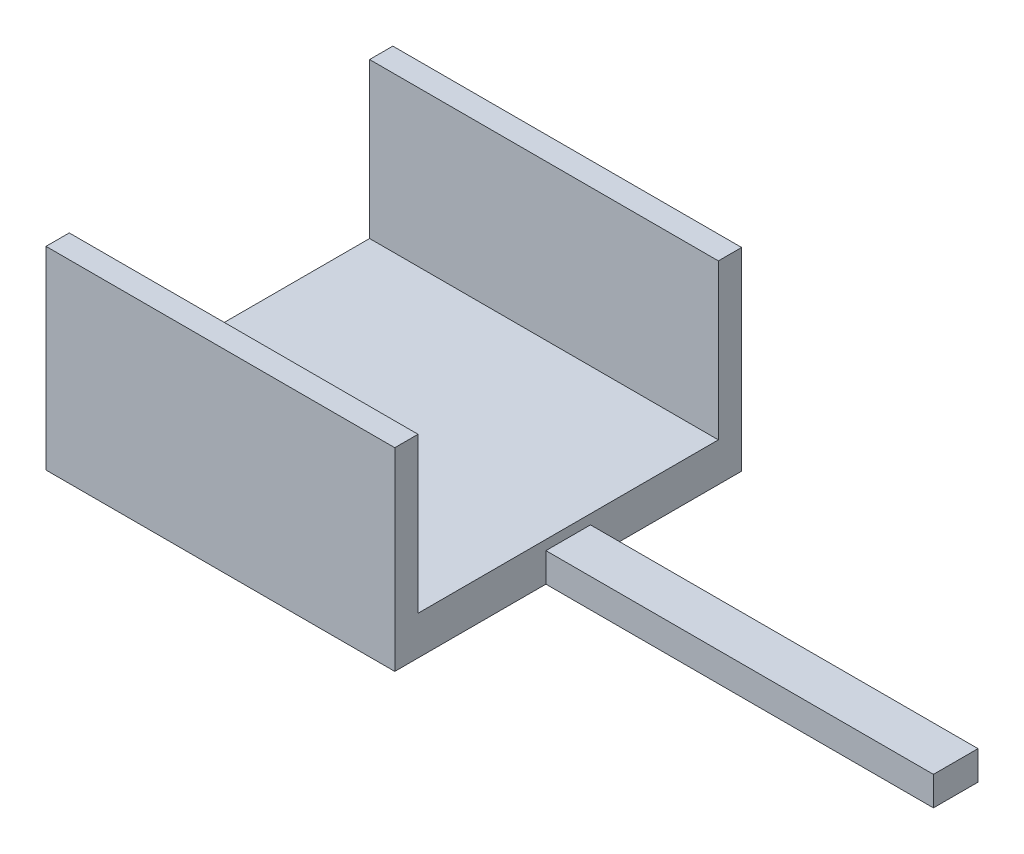
ISO-10303-21;
HEADER;
FILE_DESCRIPTION(('STEP AP214'),'2;1');
FILE_NAME('part.step','',(''),(''),'','','');
FILE_SCHEMA(('AUTOMOTIVE_DESIGN { 1 0 10303 214 1 1 1 1 }'));
ENDSEC;
DATA;
#1=APPLICATION_CONTEXT('core data for automotive mechanical design processes');
#2=APPLICATION_PROTOCOL_DEFINITION('international standard','automotive_design',2000,#1);
#3=PRODUCT_CONTEXT('',#1,'mechanical');
#4=PRODUCT('Part','Part','',(#3));
#5=PRODUCT_RELATED_PRODUCT_CATEGORY('part','',(#4));
#6=PRODUCT_DEFINITION_FORMATION('','',#4);
#7=PRODUCT_DEFINITION_CONTEXT('part definition',#1,'design');
#8=PRODUCT_DEFINITION('design','',#6,#7);
#9=PRODUCT_DEFINITION_SHAPE('','',#8);
#10=(LENGTH_UNIT() NAMED_UNIT(*) SI_UNIT(.MILLI.,.METRE.));
#11=(NAMED_UNIT(*) PLANE_ANGLE_UNIT() SI_UNIT($,.RADIAN.));
#12=(NAMED_UNIT(*) SI_UNIT($,.STERADIAN.) SOLID_ANGLE_UNIT());
#13=UNCERTAINTY_MEASURE_WITH_UNIT(LENGTH_MEASURE(1.E-05),#10,'distance_accuracy_value','');
#14=(GEOMETRIC_REPRESENTATION_CONTEXT(3) GLOBAL_UNCERTAINTY_ASSIGNED_CONTEXT((#13)) GLOBAL_UNIT_ASSIGNED_CONTEXT((#10,
#11,#12)) REPRESENTATION_CONTEXT('',''));
#15=CARTESIAN_POINT('',(0.,0.,0.));
#16=DIRECTION('',(0.,0.,1.));
#17=DIRECTION('',(1.,0.,0.));
#18=AXIS2_PLACEMENT_3D('',#15,#16,#17);
#19=CARTESIAN_POINT('',(0.,2.,0.));
#20=DIRECTION('',(0.,1.,0.));
#21=DIRECTION('',(0.,0.,1.));
#22=AXIS2_PLACEMENT_3D('',#19,#20,#21);
#23=PLANE('',#22);
#24=DIRECTION('',(0.,0.,1.));
#25=VECTOR('',#24,1.);
#26=CARTESIAN_POINT('',(0.,2.,-17.9));
#27=LINE('',#26,#25);
#28=CARTESIAN_POINT('',(0.,2.,-16.7));
#29=VERTEX_POINT('',#28);
#30=CARTESIAN_POINT('',(0.,2.,-1.2));
#31=VERTEX_POINT('',#30);
#32=EDGE_CURVE('E173',#29,#31,#27,.T.);
#33=ORIENTED_EDGE('',*,*,#32,.T.);
#34=DIRECTION('',(-1.,0.,0.));
#35=VECTOR('',#34,1.);
#36=CARTESIAN_POINT('',(0.,2.,-1.2));
#37=LINE('',#36,#35);
#38=CARTESIAN_POINT('',(18.,2.,-1.20000000000001));
#39=VERTEX_POINT('',#38);
#40=EDGE_CURVE('E146',#39,#31,#37,.T.);
#41=ORIENTED_EDGE('',*,*,#40,.F.);
#42=DIRECTION('',(0.,0.,-1.));
#43=VECTOR('',#42,1.);
#44=CARTESIAN_POINT('',(18.,2.,-17.9));
#45=LINE('',#44,#43);
#46=CARTESIAN_POINT('',(18.,2.,-16.7));
#47=VERTEX_POINT('',#46);
#48=EDGE_CURVE('E175',#39,#47,#45,.T.);
#49=ORIENTED_EDGE('',*,*,#48,.T.);
#50=DIRECTION('',(1.,0.,0.));
#51=VECTOR('',#50,1.);
#52=CARTESIAN_POINT('',(0.,2.,-16.7));
#53=LINE('',#52,#51);
#54=EDGE_CURVE('E57',#29,#47,#53,.T.);
#55=ORIENTED_EDGE('',*,*,#54,.F.);
#56=EDGE_LOOP('',(#33,#41,#49,#55));
#57=FACE_BOUND('',#56,.T.);
#58=ADVANCED_FACE('F33',(#57),#23,.T.);
#59=CARTESIAN_POINT('',(0.,1.5,0.));
#60=DIRECTION('',(0.,-1.,0.));
#61=DIRECTION('',(0.,0.,-1.));
#62=AXIS2_PLACEMENT_3D('',#59,#60,#61);
#63=PLANE('',#62);
#64=DIRECTION('',(0.,0.,-1.));
#65=VECTOR('',#64,1.);
#66=CARTESIAN_POINT('',(18.,1.5,-17.9));
#67=LINE('',#66,#65);
#68=CARTESIAN_POINT('',(18.,1.5,-7.8));
#69=VERTEX_POINT('',#68);
#70=CARTESIAN_POINT('',(18.,1.5,-10.1));
#71=VERTEX_POINT('',#70);
#72=EDGE_CURVE('E11',#69,#71,#67,.T.);
#73=ORIENTED_EDGE('',*,*,#72,.F.);
#74=DIRECTION('',(1.,0.,0.));
#75=VECTOR('',#74,1.);
#76=CARTESIAN_POINT('',(18.,1.5,-7.8));
#77=LINE('',#76,#75);
#78=CARTESIAN_POINT('',(38.,1.5,-7.8));
#79=VERTEX_POINT('',#78);
#80=EDGE_CURVE('E177',#69,#79,#77,.T.);
#81=ORIENTED_EDGE('',*,*,#80,.T.);
#82=DIRECTION('',(0.,0.,-1.));
#83=VECTOR('',#82,1.);
#84=CARTESIAN_POINT('',(38.,1.5,-7.8));
#85=LINE('',#84,#83);
#86=CARTESIAN_POINT('',(38.,1.5,-10.1));
#87=VERTEX_POINT('',#86);
#88=EDGE_CURVE('E179',#79,#87,#85,.T.);
#89=ORIENTED_EDGE('',*,*,#88,.T.);
#90=DIRECTION('',(-1.,0.,0.));
#91=VECTOR('',#90,1.);
#92=CARTESIAN_POINT('',(18.,1.5,-10.1));
#93=LINE('',#92,#91);
#94=EDGE_CURVE('E182',#87,#71,#93,.T.);
#95=ORIENTED_EDGE('',*,*,#94,.T.);
#96=EDGE_LOOP('',(#73,#81,#89,#95));
#97=FACE_BOUND('',#96,.T.);
#98=ADVANCED_FACE('F233',(#97),#63,.F.);
#99=CARTESIAN_POINT('',(0.,1.5,0.));
#100=DIRECTION('',(1.,0.,0.));
#101=DIRECTION('',(0.,0.,-1.));
#102=AXIS2_PLACEMENT_3D('',#99,#100,#101);
#103=PLANE('',#102);
#104=DIRECTION('',(0.,0.,1.));
#105=VECTOR('',#104,1.);
#106=CARTESIAN_POINT('',(0.,0.,0.));
#107=LINE('',#106,#105);
#108=CARTESIAN_POINT('',(0.,0.,-17.9));
#109=VERTEX_POINT('',#108);
#110=CARTESIAN_POINT('',(0.,0.,0.));
#111=VERTEX_POINT('',#110);
#112=EDGE_CURVE('E132',#109,#111,#107,.T.);
#113=ORIENTED_EDGE('',*,*,#112,.T.);
#114=DIRECTION('',(0.,-1.,0.));
#115=VECTOR('',#114,1.);
#116=CARTESIAN_POINT('',(0.,1.5,0.));
#117=LINE('',#116,#115);
#118=CARTESIAN_POINT('',(0.,10.,0.));
#119=VERTEX_POINT('',#118);
#120=EDGE_CURVE('E37',#119,#111,#117,.T.);
#121=ORIENTED_EDGE('',*,*,#120,.F.);
#122=DIRECTION('',(0.,0.,1.));
#123=VECTOR('',#122,1.);
#124=CARTESIAN_POINT('',(0.,10.,0.));
#125=LINE('',#124,#123);
#126=CARTESIAN_POINT('',(0.,10.,-1.2));
#127=VERTEX_POINT('',#126);
#128=EDGE_CURVE('E129',#127,#119,#125,.T.);
#129=ORIENTED_EDGE('',*,*,#128,.F.);
#130=DIRECTION('',(0.,-1.,0.));
#131=VECTOR('',#130,1.);
#132=CARTESIAN_POINT('',(0.,10.,-1.2));
#133=LINE('',#132,#131);
#134=EDGE_CURVE('E151',#127,#31,#133,.T.);
#135=ORIENTED_EDGE('',*,*,#134,.T.);
#136=ORIENTED_EDGE('',*,*,#32,.F.);
#137=DIRECTION('',(0.,-1.,0.));
#138=VECTOR('',#137,1.);
#139=CARTESIAN_POINT('',(0.,10.,-16.7));
#140=LINE('',#139,#138);
#141=CARTESIAN_POINT('',(0.,10.,-16.7));
#142=VERTEX_POINT('',#141);
#143=EDGE_CURVE('E170',#142,#29,#140,.T.);
#144=ORIENTED_EDGE('',*,*,#143,.F.);
#145=DIRECTION('',(0.,0.,1.));
#146=VECTOR('',#145,1.);
#147=CARTESIAN_POINT('',(0.,10.,-17.9));
#148=LINE('',#147,#146);
#149=CARTESIAN_POINT('',(0.,10.,-17.9));
#150=VERTEX_POINT('',#149);
#151=EDGE_CURVE('E155',#150,#142,#148,.T.);
#152=ORIENTED_EDGE('',*,*,#151,.F.);
#153=DIRECTION('',(0.,-1.,0.));
#154=VECTOR('',#153,1.);
#155=CARTESIAN_POINT('',(0.,1.5,-17.9));
#156=LINE('',#155,#154);
#157=EDGE_CURVE('E184',#150,#109,#156,.T.);
#158=ORIENTED_EDGE('',*,*,#157,.T.);
#159=EDGE_LOOP('',(#113,#121,#129,#135,#136,#144,#152,#158));
#160=FACE_BOUND('',#159,.T.);
#161=ADVANCED_FACE('F35',(#160),#103,.F.);
#162=CARTESIAN_POINT('',(0.,1.5,0.));
#163=DIRECTION('',(0.,0.,-1.));
#164=DIRECTION('',(-1.,0.,0.));
#165=AXIS2_PLACEMENT_3D('',#162,#163,#164);
#166=PLANE('',#165);
#167=DIRECTION('',(1.,0.,0.));
#168=VECTOR('',#167,1.);
#169=CARTESIAN_POINT('',(0.,0.,0.));
#170=LINE('',#169,#168);
#171=CARTESIAN_POINT('',(18.,0.,0.));
#172=VERTEX_POINT('',#171);
#173=EDGE_CURVE('E186',#111,#172,#170,.T.);
#174=ORIENTED_EDGE('',*,*,#173,.T.);
#175=DIRECTION('',(0.,-1.,0.));
#176=VECTOR('',#175,1.);
#177=CARTESIAN_POINT('',(18.,1.5,0.));
#178=LINE('',#177,#176);
#179=CARTESIAN_POINT('',(18.,10.,0.));
#180=VERTEX_POINT('',#179);
#181=EDGE_CURVE('E134',#180,#172,#178,.T.);
#182=ORIENTED_EDGE('',*,*,#181,.F.);
#183=DIRECTION('',(1.,0.,0.));
#184=VECTOR('',#183,1.);
#185=CARTESIAN_POINT('',(0.,10.,0.));
#186=LINE('',#185,#184);
#187=EDGE_CURVE('E136',#119,#180,#186,.T.);
#188=ORIENTED_EDGE('',*,*,#187,.F.);
#189=ORIENTED_EDGE('',*,*,#120,.T.);
#190=EDGE_LOOP('',(#174,#182,#188,#189));
#191=FACE_BOUND('',#190,.T.);
#192=ADVANCED_FACE('F137',(#191),#166,.F.);
#193=CARTESIAN_POINT('',(18.,1.5,-7.8));
#194=DIRECTION('',(0.,0.,-1.));
#195=DIRECTION('',(-1.,0.,0.));
#196=AXIS2_PLACEMENT_3D('',#193,#194,#195);
#197=PLANE('',#196);
#198=DIRECTION('',(1.,0.,0.));
#199=VECTOR('',#198,1.);
#200=CARTESIAN_POINT('',(18.,0.,-7.8));
#201=LINE('',#200,#199);
#202=CARTESIAN_POINT('',(18.,0.,-7.8));
#203=VERTEX_POINT('',#202);
#204=CARTESIAN_POINT('',(38.,0.,-7.8));
#205=VERTEX_POINT('',#204);
#206=EDGE_CURVE('E190',#203,#205,#201,.T.);
#207=ORIENTED_EDGE('',*,*,#206,.T.);
#208=DIRECTION('',(0.,-1.,0.));
#209=VECTOR('',#208,1.);
#210=CARTESIAN_POINT('',(38.,1.5,-7.8));
#211=LINE('',#210,#209);
#212=EDGE_CURVE('E209',#79,#205,#211,.T.);
#213=ORIENTED_EDGE('',*,*,#212,.F.);
#214=ORIENTED_EDGE('',*,*,#80,.F.);
#215=DIRECTION('',(0.,-1.,0.));
#216=VECTOR('',#215,1.);
#217=CARTESIAN_POINT('',(18.,1.5,-7.8));
#218=LINE('',#217,#216);
#219=EDGE_CURVE('E212',#69,#203,#218,.T.);
#220=ORIENTED_EDGE('',*,*,#219,.T.);
#221=EDGE_LOOP('',(#207,#213,#214,#220));
#222=FACE_BOUND('',#221,.T.);
#223=ADVANCED_FACE('F225',(#222),#197,.F.);
#224=CARTESIAN_POINT('',(38.,1.5,-7.8));
#225=DIRECTION('',(-1.,0.,0.));
#226=DIRECTION('',(0.,0.,1.));
#227=AXIS2_PLACEMENT_3D('',#224,#225,#226);
#228=PLANE('',#227);
#229=DIRECTION('',(0.,0.,-1.));
#230=VECTOR('',#229,1.);
#231=CARTESIAN_POINT('',(38.,0.,-7.8));
#232=LINE('',#231,#230);
#233=CARTESIAN_POINT('',(38.,0.,-10.1));
#234=VERTEX_POINT('',#233);
#235=EDGE_CURVE('E192',#205,#234,#232,.T.);
#236=ORIENTED_EDGE('',*,*,#235,.T.);
#237=DIRECTION('',(0.,-1.,0.));
#238=VECTOR('',#237,1.);
#239=CARTESIAN_POINT('',(38.,1.5,-10.1));
#240=LINE('',#239,#238);
#241=EDGE_CURVE('E206',#87,#234,#240,.T.);
#242=ORIENTED_EDGE('',*,*,#241,.F.);
#243=ORIENTED_EDGE('',*,*,#88,.F.);
#244=ORIENTED_EDGE('',*,*,#212,.T.);
#245=EDGE_LOOP('',(#236,#242,#243,#244));
#246=FACE_BOUND('',#245,.T.);
#247=ADVANCED_FACE('F229',(#246),#228,.F.);
#248=CARTESIAN_POINT('',(18.,1.5,-10.1));
#249=DIRECTION('',(0.,0.,1.));
#250=DIRECTION('',(1.,0.,0.));
#251=AXIS2_PLACEMENT_3D('',#248,#249,#250);
#252=PLANE('',#251);
#253=DIRECTION('',(-1.,0.,0.));
#254=VECTOR('',#253,1.);
#255=CARTESIAN_POINT('',(18.,0.,-10.1));
#256=LINE('',#255,#254);
#257=CARTESIAN_POINT('',(18.,0.,-10.1));
#258=VERTEX_POINT('',#257);
#259=EDGE_CURVE('E194',#234,#258,#256,.T.);
#260=ORIENTED_EDGE('',*,*,#259,.T.);
#261=DIRECTION('',(0.,-1.,0.));
#262=VECTOR('',#261,1.);
#263=CARTESIAN_POINT('',(18.,1.5,-10.1));
#264=LINE('',#263,#262);
#265=EDGE_CURVE('E203',#71,#258,#264,.T.);
#266=ORIENTED_EDGE('',*,*,#265,.F.);
#267=ORIENTED_EDGE('',*,*,#94,.F.);
#268=ORIENTED_EDGE('',*,*,#241,.T.);
#269=EDGE_LOOP('',(#260,#266,#267,#268));
#270=FACE_BOUND('',#269,.T.);
#271=ADVANCED_FACE('F270',(#270),#252,.F.);
#272=CARTESIAN_POINT('',(18.,1.5,-10.1));
#273=DIRECTION('',(-1.,0.,0.));
#274=DIRECTION('',(0.,0.,1.));
#275=AXIS2_PLACEMENT_3D('',#272,#273,#274);
#276=PLANE('',#275);
#277=DIRECTION('',(0.,0.,-1.));
#278=VECTOR('',#277,1.);
#279=CARTESIAN_POINT('',(18.,0.,-10.1));
#280=LINE('',#279,#278);
#281=CARTESIAN_POINT('',(18.,0.,-17.9));
#282=VERTEX_POINT('',#281);
#283=EDGE_CURVE('E196',#258,#282,#280,.T.);
#284=ORIENTED_EDGE('',*,*,#283,.T.);
#285=DIRECTION('',(0.,-1.,0.));
#286=VECTOR('',#285,1.);
#287=CARTESIAN_POINT('',(18.,1.5,-17.9));
#288=LINE('',#287,#286);
#289=CARTESIAN_POINT('',(18.,10.,-17.9));
#290=VERTEX_POINT('',#289);
#291=EDGE_CURVE('E200',#290,#282,#288,.T.);
#292=ORIENTED_EDGE('',*,*,#291,.F.);
#293=DIRECTION('',(0.,0.,-1.));
#294=VECTOR('',#293,1.);
#295=CARTESIAN_POINT('',(18.,10.,-17.9));
#296=LINE('',#295,#294);
#297=CARTESIAN_POINT('',(18.,10.,-16.7));
#298=VERTEX_POINT('',#297);
#299=EDGE_CURVE('E160',#298,#290,#296,.T.);
#300=ORIENTED_EDGE('',*,*,#299,.F.);
#301=DIRECTION('',(0.,-1.,0.));
#302=VECTOR('',#301,1.);
#303=CARTESIAN_POINT('',(18.,10.,-16.7));
#304=LINE('',#303,#302);
#305=EDGE_CURVE('E166',#298,#47,#304,.T.);
#306=ORIENTED_EDGE('',*,*,#305,.T.);
#307=ORIENTED_EDGE('',*,*,#48,.F.);
#308=DIRECTION('',(0.,-1.,0.));
#309=VECTOR('',#308,1.);
#310=CARTESIAN_POINT('',(18.,10.,-1.2));
#311=LINE('',#310,#309);
#312=CARTESIAN_POINT('',(18.,10.,-1.2));
#313=VERTEX_POINT('',#312);
#314=EDGE_CURVE('E49',#313,#39,#311,.T.);
#315=ORIENTED_EDGE('',*,*,#314,.F.);
#316=DIRECTION('',(0.,0.,-1.));
#317=VECTOR('',#316,1.);
#318=CARTESIAN_POINT('',(18.,10.,0.));
#319=LINE('',#318,#317);
#320=EDGE_CURVE('E141',#180,#313,#319,.T.);
#321=ORIENTED_EDGE('',*,*,#320,.F.);
#322=ORIENTED_EDGE('',*,*,#181,.T.);
#323=DIRECTION('',(0.,0.,-1.));
#324=VECTOR('',#323,1.);
#325=CARTESIAN_POINT('',(18.,0.,0.));
#326=LINE('',#325,#324);
#327=EDGE_CURVE('E188',#172,#203,#326,.T.);
#328=ORIENTED_EDGE('',*,*,#327,.T.);
#329=ORIENTED_EDGE('',*,*,#219,.F.);
#330=ORIENTED_EDGE('',*,*,#72,.T.);
#331=ORIENTED_EDGE('',*,*,#265,.T.);
#332=EDGE_LOOP('',(#284,#292,#300,#306,#307,#315,#321,#322,#328,#329,#330,#331));
#333=FACE_BOUND('',#332,.T.);
#334=ADVANCED_FACE('F216',(#333),#276,.F.);
#335=CARTESIAN_POINT('',(0.,1.5,-17.9));
#336=DIRECTION('',(0.,0.,1.));
#337=DIRECTION('',(1.,0.,0.));
#338=AXIS2_PLACEMENT_3D('',#335,#336,#337);
#339=PLANE('',#338);
#340=DIRECTION('',(-1.,0.,0.));
#341=VECTOR('',#340,1.);
#342=CARTESIAN_POINT('',(0.,0.,-17.9));
#343=LINE('',#342,#341);
#344=EDGE_CURVE('E180',#282,#109,#343,.T.);
#345=ORIENTED_EDGE('',*,*,#344,.T.);
#346=ORIENTED_EDGE('',*,*,#157,.F.);
#347=DIRECTION('',(-1.,0.,0.));
#348=VECTOR('',#347,1.);
#349=CARTESIAN_POINT('',(0.,10.,-17.9));
#350=LINE('',#349,#348);
#351=EDGE_CURVE('E163',#290,#150,#350,.T.);
#352=ORIENTED_EDGE('',*,*,#351,.F.);
#353=ORIENTED_EDGE('',*,*,#291,.T.);
#354=EDGE_LOOP('',(#345,#346,#352,#353));
#355=FACE_BOUND('',#354,.T.);
#356=ADVANCED_FACE('F239',(#355),#339,.F.);
#357=CARTESIAN_POINT('',(0.,0.,0.));
#358=DIRECTION('',(0.,-1.,0.));
#359=DIRECTION('',(0.,0.,-1.));
#360=AXIS2_PLACEMENT_3D('',#357,#358,#359);
#361=PLANE('',#360);
#362=ORIENTED_EDGE('',*,*,#112,.F.);
#363=ORIENTED_EDGE('',*,*,#344,.F.);
#364=ORIENTED_EDGE('',*,*,#283,.F.);
#365=ORIENTED_EDGE('',*,*,#259,.F.);
#366=ORIENTED_EDGE('',*,*,#235,.F.);
#367=ORIENTED_EDGE('',*,*,#206,.F.);
#368=ORIENTED_EDGE('',*,*,#327,.F.);
#369=ORIENTED_EDGE('',*,*,#173,.F.);
#370=EDGE_LOOP('',(#362,#363,#364,#365,#366,#367,#368,#369));
#371=FACE_BOUND('',#370,.T.);
#372=ADVANCED_FACE('F220',(#371),#361,.T.);
#373=CARTESIAN_POINT('',(0.,10.,-16.7));
#374=DIRECTION('',(0.,0.,-1.));
#375=DIRECTION('',(-1.,0.,0.));
#376=AXIS2_PLACEMENT_3D('',#373,#374,#375);
#377=PLANE('',#376);
#378=ORIENTED_EDGE('',*,*,#54,.T.);
#379=ORIENTED_EDGE('',*,*,#305,.F.);
#380=DIRECTION('',(1.,0.,0.));
#381=VECTOR('',#380,1.);
#382=CARTESIAN_POINT('',(0.,10.,-16.7));
#383=LINE('',#382,#381);
#384=EDGE_CURVE('E158',#142,#298,#383,.T.);
#385=ORIENTED_EDGE('',*,*,#384,.F.);
#386=ORIENTED_EDGE('',*,*,#143,.T.);
#387=EDGE_LOOP('',(#378,#379,#385,#386));
#388=FACE_BOUND('',#387,.T.);
#389=ADVANCED_FACE('F249',(#388),#377,.F.);
#390=CARTESIAN_POINT('',(0.,10.,0.));
#391=DIRECTION('',(0.,1.,0.));
#392=DIRECTION('',(0.,0.,1.));
#393=AXIS2_PLACEMENT_3D('',#390,#391,#392);
#394=PLANE('',#393);
#395=ORIENTED_EDGE('',*,*,#151,.T.);
#396=ORIENTED_EDGE('',*,*,#384,.T.);
#397=ORIENTED_EDGE('',*,*,#299,.T.);
#398=ORIENTED_EDGE('',*,*,#351,.T.);
#399=EDGE_LOOP('',(#395,#396,#397,#398));
#400=FACE_BOUND('',#399,.T.);
#401=ADVANCED_FACE('F244',(#400),#394,.T.);
#402=CARTESIAN_POINT('',(0.,10.,-1.2));
#403=DIRECTION('',(0.,0.,1.));
#404=DIRECTION('',(1.,0.,0.));
#405=AXIS2_PLACEMENT_3D('',#402,#403,#404);
#406=PLANE('',#405);
#407=ORIENTED_EDGE('',*,*,#40,.T.);
#408=ORIENTED_EDGE('',*,*,#134,.F.);
#409=DIRECTION('',(-1.,0.,0.));
#410=VECTOR('',#409,1.);
#411=CARTESIAN_POINT('',(0.,10.,-1.2));
#412=LINE('',#411,#410);
#413=EDGE_CURVE('E144',#313,#127,#412,.T.);
#414=ORIENTED_EDGE('',*,*,#413,.F.);
#415=ORIENTED_EDGE('',*,*,#314,.T.);
#416=EDGE_LOOP('',(#407,#408,#414,#415));
#417=FACE_BOUND('',#416,.T.);
#418=ADVANCED_FACE('F256',(#417),#406,.F.);
#419=CARTESIAN_POINT('',(0.,10.,0.));
#420=DIRECTION('',(0.,-1.,0.));
#421=DIRECTION('',(0.,0.,-1.));
#422=AXIS2_PLACEMENT_3D('',#419,#420,#421);
#423=PLANE('',#422);
#424=ORIENTED_EDGE('',*,*,#128,.T.);
#425=ORIENTED_EDGE('',*,*,#187,.T.);
#426=ORIENTED_EDGE('',*,*,#320,.T.);
#427=ORIENTED_EDGE('',*,*,#413,.T.);
#428=EDGE_LOOP('',(#424,#425,#426,#427));
#429=FACE_BOUND('',#428,.T.);
#430=ADVANCED_FACE('F143',(#429),#423,.F.);
#431=CLOSED_SHELL('',(#58,#98,#161,#192,#223,#247,#271,#334,#356,#372,#389,#401,#418,#430));
#432=MANIFOLD_SOLID_BREP('B2',#431);
#433=ADVANCED_BREP_SHAPE_REPRESENTATION('',(#18,#432),#14);
#434=SHAPE_DEFINITION_REPRESENTATION(#9,#433);
ENDSEC;
END-ISO-10303-21;
